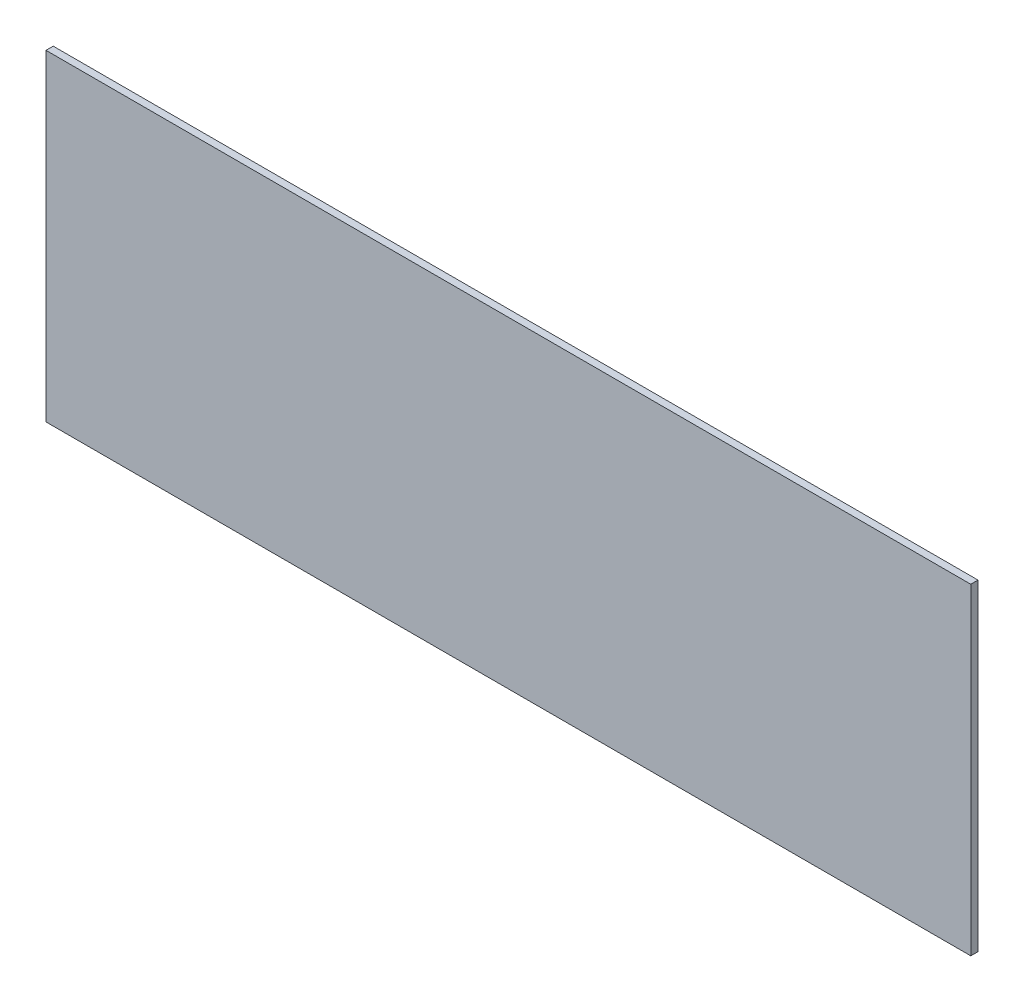
ISO-10303-21;
HEADER;
FILE_DESCRIPTION(('STEP AP214'),'2;1');
FILE_NAME('part.step','',(''),(''),'','','');
FILE_SCHEMA(('AUTOMOTIVE_DESIGN { 1 0 10303 214 1 1 1 1 }'));
ENDSEC;
DATA;
#1=APPLICATION_CONTEXT('core data for automotive mechanical design processes');
#2=APPLICATION_PROTOCOL_DEFINITION('international standard','automotive_design',2000,#1);
#3=PRODUCT_CONTEXT('',#1,'mechanical');
#4=PRODUCT('Part','Part','',(#3));
#5=PRODUCT_RELATED_PRODUCT_CATEGORY('part','',(#4));
#6=PRODUCT_DEFINITION_FORMATION('','',#4);
#7=PRODUCT_DEFINITION_CONTEXT('part definition',#1,'design');
#8=PRODUCT_DEFINITION('design','',#6,#7);
#9=PRODUCT_DEFINITION_SHAPE('','',#8);
#10=(LENGTH_UNIT() NAMED_UNIT(*) SI_UNIT(.MILLI.,.METRE.));
#11=(NAMED_UNIT(*) PLANE_ANGLE_UNIT() SI_UNIT($,.RADIAN.));
#12=(NAMED_UNIT(*) SI_UNIT($,.STERADIAN.) SOLID_ANGLE_UNIT());
#13=UNCERTAINTY_MEASURE_WITH_UNIT(LENGTH_MEASURE(1.E-05),#10,'distance_accuracy_value','');
#14=(GEOMETRIC_REPRESENTATION_CONTEXT(3) GLOBAL_UNCERTAINTY_ASSIGNED_CONTEXT((#13)) GLOBAL_UNIT_ASSIGNED_CONTEXT((#10,
#11,#12)) REPRESENTATION_CONTEXT('',''));
#15=CARTESIAN_POINT('',(0.,0.,0.));
#16=DIRECTION('',(0.,0.,1.));
#17=DIRECTION('',(1.,0.,0.));
#18=AXIS2_PLACEMENT_3D('',#15,#16,#17);
#19=CARTESIAN_POINT('',(151.010023904325,76.2,-1.52400000000075));
#20=DIRECTION('',(0.,1.,0.));
#21=DIRECTION('',(-1.,0.,0.));
#22=AXIS2_PLACEMENT_3D('',#19,#20,#21);
#23=PLANE('',#22);
#24=DIRECTION('',(1.,0.,0.));
#25=VECTOR('',#24,1.);
#26=CARTESIAN_POINT('',(154.439023904325,76.2,-1.11022302462516E-13));
#27=LINE('',#26,#25);
#28=CARTESIAN_POINT('',(-103.639023904325,76.2,-1.35687267668402E-13));
#29=VERTEX_POINT('',#28);
#30=CARTESIAN_POINT('',(334.278047808651,76.2,1.29896093881143E-11));
#31=VERTEX_POINT('',#30);
#32=EDGE_CURVE('E53',#29,#31,#27,.T.);
#33=ORIENTED_EDGE('',*,*,#32,.F.);
#34=DIRECTION('',(0.,0.,-1.));
#35=VECTOR('',#34,1.);
#36=CARTESIAN_POINT('',(-103.639023904325,76.2,3.42899999999986));
#37=LINE('',#36,#35);
#38=CARTESIAN_POINT('',(-103.639023904325,76.2,3.42899999999986));
#39=VERTEX_POINT('',#38);
#40=EDGE_CURVE('E110',#39,#29,#37,.T.);
#41=ORIENTED_EDGE('',*,*,#40,.F.);
#42=DIRECTION('',(1.,0.,0.));
#43=VECTOR('',#42,1.);
#44=CARTESIAN_POINT('',(154.439023904325,76.2,3.42899999999988));
#45=LINE('',#44,#43);
#46=CARTESIAN_POINT('',(334.27804780865,76.2,3.429000000013));
#47=VERTEX_POINT('',#46);
#48=EDGE_CURVE('E12',#39,#47,#45,.T.);
#49=ORIENTED_EDGE('',*,*,#48,.T.);
#50=DIRECTION('',(0.,0.,1.));
#51=VECTOR('',#50,1.);
#52=CARTESIAN_POINT('',(334.278047808651,76.2,1.29896093881143E-11));
#53=LINE('',#52,#51);
#54=EDGE_CURVE('E96',#31,#47,#53,.T.);
#55=ORIENTED_EDGE('',*,*,#54,.F.);
#56=EDGE_LOOP('',(#33,#41,#49,#55));
#57=FACE_BOUND('',#56,.T.);
#58=ADVANCED_FACE('F43',(#57),#23,.T.);
#59=CARTESIAN_POINT('',(284.868023904325,-76.2,-1.52399999999062));
#60=DIRECTION('',(0.,-1.,0.));
#61=DIRECTION('',(1.,0.,0.));
#62=AXIS2_PLACEMENT_3D('',#59,#60,#61);
#63=PLANE('',#62);
#64=DIRECTION('',(1.,0.,0.));
#65=VECTOR('',#64,1.);
#66=CARTESIAN_POINT('',(154.439023904325,-76.2,-1.11022302462516E-13));
#67=LINE('',#66,#65);
#68=CARTESIAN_POINT('',(-103.639023904325,-76.2,-1.35687267668402E-13));
#69=VERTEX_POINT('',#68);
#70=CARTESIAN_POINT('',(334.278047808651,-76.2,1.29896093881143E-11));
#71=VERTEX_POINT('',#70);
#72=EDGE_CURVE('E73',#69,#71,#67,.T.);
#73=ORIENTED_EDGE('',*,*,#72,.T.);
#74=DIRECTION('',(0.,0.,1.));
#75=VECTOR('',#74,1.);
#76=CARTESIAN_POINT('',(334.278047808651,-76.2,1.29896093881143E-11));
#77=LINE('',#76,#75);
#78=CARTESIAN_POINT('',(334.27804780865,-76.2,3.429000000013));
#79=VERTEX_POINT('',#78);
#80=EDGE_CURVE('E98',#71,#79,#77,.T.);
#81=ORIENTED_EDGE('',*,*,#80,.T.);
#82=DIRECTION('',(1.,0.,0.));
#83=VECTOR('',#82,1.);
#84=CARTESIAN_POINT('',(154.439023904325,-76.2,3.42899999999988));
#85=LINE('',#84,#83);
#86=CARTESIAN_POINT('',(-103.639023904325,-76.2,3.42899999999986));
#87=VERTEX_POINT('',#86);
#88=EDGE_CURVE('E47',#87,#79,#85,.T.);
#89=ORIENTED_EDGE('',*,*,#88,.F.);
#90=DIRECTION('',(0.,0.,-1.));
#91=VECTOR('',#90,1.);
#92=CARTESIAN_POINT('',(-103.639023904325,-76.2,3.42899999999986));
#93=LINE('',#92,#91);
#94=EDGE_CURVE('E104',#87,#69,#93,.T.);
#95=ORIENTED_EDGE('',*,*,#94,.T.);
#96=EDGE_LOOP('',(#73,#81,#89,#95));
#97=FACE_BOUND('',#96,.T.);
#98=ADVANCED_FACE('F112',(#97),#63,.T.);
#99=CARTESIAN_POINT('',(0.,76.2,0.));
#100=DIRECTION('',(0.,0.,-1.));
#101=DIRECTION('',(-1.,0.,0.));
#102=AXIS2_PLACEMENT_3D('',#99,#100,#101);
#103=PLANE('',#102);
#104=ORIENTED_EDGE('',*,*,#72,.F.);
#105=DIRECTION('',(0.,-1.,0.));
#106=VECTOR('',#105,1.);
#107=CARTESIAN_POINT('',(-103.639023904325,76.2,-1.35687267668402E-13));
#108=LINE('',#107,#106);
#109=EDGE_CURVE('E90',#29,#69,#108,.T.);
#110=ORIENTED_EDGE('',*,*,#109,.F.);
#111=ORIENTED_EDGE('',*,*,#32,.T.);
#112=DIRECTION('',(0.,-1.,0.));
#113=VECTOR('',#112,1.);
#114=CARTESIAN_POINT('',(334.278047808651,76.2,1.29896093881143E-11));
#115=LINE('',#114,#113);
#116=EDGE_CURVE('E88',#31,#71,#115,.T.);
#117=ORIENTED_EDGE('',*,*,#116,.T.);
#118=EDGE_LOOP('',(#104,#110,#111,#117));
#119=FACE_BOUND('',#118,.T.);
#120=ADVANCED_FACE('F45',(#119),#103,.T.);
#121=CARTESIAN_POINT('',(154.439023904325,76.2,3.42899999999988));
#122=DIRECTION('',(0.,0.,-1.));
#123=DIRECTION('',(-1.,0.,0.));
#124=AXIS2_PLACEMENT_3D('',#121,#122,#123);
#125=PLANE('',#124);
#126=ORIENTED_EDGE('',*,*,#88,.T.);
#127=DIRECTION('',(0.,-1.,0.));
#128=VECTOR('',#127,1.);
#129=CARTESIAN_POINT('',(334.27804780865,76.2,3.429000000013));
#130=LINE('',#129,#128);
#131=EDGE_CURVE('E99',#47,#79,#130,.T.);
#132=ORIENTED_EDGE('',*,*,#131,.F.);
#133=ORIENTED_EDGE('',*,*,#48,.F.);
#134=DIRECTION('',(0.,-1.,0.));
#135=VECTOR('',#134,1.);
#136=CARTESIAN_POINT('',(-103.639023904325,76.2,3.42899999999986));
#137=LINE('',#136,#135);
#138=EDGE_CURVE('E107',#39,#87,#137,.T.);
#139=ORIENTED_EDGE('',*,*,#138,.T.);
#140=EDGE_LOOP('',(#126,#132,#133,#139));
#141=FACE_BOUND('',#140,.T.);
#142=ADVANCED_FACE('F116',(#141),#125,.F.);
#143=CARTESIAN_POINT('',(-103.639023904325,76.2,3.42899999999986));
#144=DIRECTION('',(-1.,0.,0.));
#145=DIRECTION('',(0.,0.,1.));
#146=AXIS2_PLACEMENT_3D('',#143,#144,#145);
#147=PLANE('',#146);
#148=ORIENTED_EDGE('',*,*,#94,.F.);
#149=ORIENTED_EDGE('',*,*,#138,.F.);
#150=ORIENTED_EDGE('',*,*,#40,.T.);
#151=ORIENTED_EDGE('',*,*,#109,.T.);
#152=EDGE_LOOP('',(#148,#149,#150,#151));
#153=FACE_BOUND('',#152,.T.);
#154=ADVANCED_FACE('F115',(#153),#147,.T.);
#155=CARTESIAN_POINT('',(334.278047808651,76.2,1.29896093881143E-11));
#156=DIRECTION('',(1.,0.,0.));
#157=DIRECTION('',(0.,0.,-1.));
#158=AXIS2_PLACEMENT_3D('',#155,#156,#157);
#159=PLANE('',#158);
#160=ORIENTED_EDGE('',*,*,#80,.F.);
#161=ORIENTED_EDGE('',*,*,#116,.F.);
#162=ORIENTED_EDGE('',*,*,#54,.T.);
#163=ORIENTED_EDGE('',*,*,#131,.T.);
#164=EDGE_LOOP('',(#160,#161,#162,#163));
#165=FACE_BOUND('',#164,.T.);
#166=ADVANCED_FACE('F95',(#165),#159,.T.);
#167=CLOSED_SHELL('',(#58,#98,#120,#142,#154,#166));
#168=MANIFOLD_SOLID_BREP('B2',#167);
#169=ADVANCED_BREP_SHAPE_REPRESENTATION('',(#18,#168),#14);
#170=SHAPE_DEFINITION_REPRESENTATION(#9,#169);
ENDSEC;
END-ISO-10303-21;
